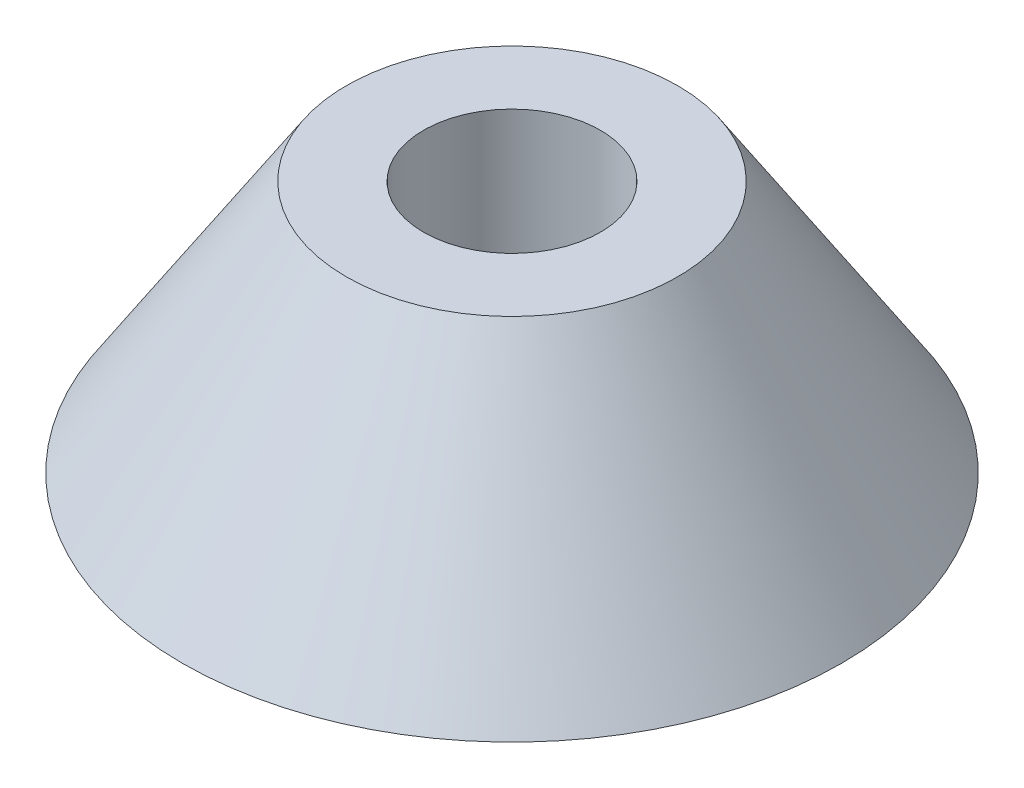
ISO-10303-21;
HEADER;
FILE_DESCRIPTION(('STEP AP214'),'2;1');
FILE_NAME('part.step','',(''),(''),'','','');
FILE_SCHEMA(('AUTOMOTIVE_DESIGN { 1 0 10303 214 1 1 1 1 }'));
ENDSEC;
DATA;
#1=APPLICATION_CONTEXT('core data for automotive mechanical design processes');
#2=APPLICATION_PROTOCOL_DEFINITION('international standard','automotive_design',2000,#1);
#3=PRODUCT_CONTEXT('',#1,'mechanical');
#4=PRODUCT('Part','Part','',(#3));
#5=PRODUCT_RELATED_PRODUCT_CATEGORY('part','',(#4));
#6=PRODUCT_DEFINITION_FORMATION('','',#4);
#7=PRODUCT_DEFINITION_CONTEXT('part definition',#1,'design');
#8=PRODUCT_DEFINITION('design','',#6,#7);
#9=PRODUCT_DEFINITION_SHAPE('','',#8);
#10=(LENGTH_UNIT() NAMED_UNIT(*) SI_UNIT(.MILLI.,.METRE.));
#11=(NAMED_UNIT(*) PLANE_ANGLE_UNIT() SI_UNIT($,.RADIAN.));
#12=(NAMED_UNIT(*) SI_UNIT($,.STERADIAN.) SOLID_ANGLE_UNIT());
#13=UNCERTAINTY_MEASURE_WITH_UNIT(LENGTH_MEASURE(1.E-05),#10,'distance_accuracy_value','');
#14=(GEOMETRIC_REPRESENTATION_CONTEXT(3) GLOBAL_UNCERTAINTY_ASSIGNED_CONTEXT((#13)) GLOBAL_UNIT_ASSIGNED_CONTEXT((#10,
#11,#12)) REPRESENTATION_CONTEXT('',''));
#15=CARTESIAN_POINT('',(0.,0.,0.));
#16=DIRECTION('',(0.,0.,1.));
#17=DIRECTION('',(1.,0.,0.));
#18=AXIS2_PLACEMENT_3D('',#15,#16,#17);
#19=CARTESIAN_POINT('',(0.,5.,0.));
#20=DIRECTION('',(0.,1.,0.));
#21=DIRECTION('',(0.,0.,1.));
#22=AXIS2_PLACEMENT_3D('',#19,#20,#21);
#23=PLANE('',#22);
#24=CARTESIAN_POINT('',(0.,5.,0.));
#25=DIRECTION('',(0.,1.,0.));
#26=DIRECTION('',(0.,0.,1.));
#27=AXIS2_PLACEMENT_3D('',#24,#25,#26);
#28=CIRCLE('',#27,3.2788506442161);
#29=CARTESIAN_POINT('',(0.,5.,3.2788506442161));
#30=VERTEX_POINT('',#29);
#31=EDGE_CURVE('E45',#30,#30,#28,.T.);
#32=ORIENTED_EDGE('',*,*,#31,.T.);
#33=EDGE_LOOP('',(#32));
#34=FACE_BOUND('',#33,.T.);
#35=CARTESIAN_POINT('',(0.,5.,0.));
#36=DIRECTION('',(0.,1.,0.));
#37=DIRECTION('',(0.,0.,1.));
#38=AXIS2_PLACEMENT_3D('',#35,#36,#37);
#39=CIRCLE('',#38,1.75);
#40=CARTESIAN_POINT('',(0.,5.,1.75));
#41=VERTEX_POINT('',#40);
#42=EDGE_CURVE('E50',#41,#41,#39,.T.);
#43=ORIENTED_EDGE('',*,*,#42,.F.);
#44=EDGE_LOOP('',(#43));
#45=FACE_BOUND('',#44,.T.);
#46=ADVANCED_FACE('F37',(#34,#45),#23,.T.);
#47=CARTESIAN_POINT('',(0.,0.,0.));
#48=DIRECTION('',(0.,1.,0.));
#49=DIRECTION('',(0.,0.,1.));
#50=AXIS2_PLACEMENT_3D('',#47,#48,#49);
#51=PLANE('',#50);
#52=CARTESIAN_POINT('',(0.,0.,0.));
#53=DIRECTION('',(0.,1.,0.));
#54=DIRECTION('',(0.,0.,1.));
#55=AXIS2_PLACEMENT_3D('',#52,#53,#54);
#56=CIRCLE('',#55,6.5258886102037);
#57=CARTESIAN_POINT('',(0.,0.,6.5258886102037));
#58=VERTEX_POINT('',#57);
#59=EDGE_CURVE('E10',#58,#58,#56,.F.);
#60=ORIENTED_EDGE('',*,*,#59,.T.);
#61=EDGE_LOOP('',(#60));
#62=FACE_BOUND('',#61,.T.);
#63=CARTESIAN_POINT('',(0.,0.,0.));
#64=DIRECTION('',(0.,1.,0.));
#65=DIRECTION('',(0.,0.,1.));
#66=AXIS2_PLACEMENT_3D('',#63,#64,#65);
#67=CIRCLE('',#66,1.75);
#68=CARTESIAN_POINT('',(0.,0.,1.75));
#69=VERTEX_POINT('',#68);
#70=EDGE_CURVE('E55',#69,#69,#67,.T.);
#71=ORIENTED_EDGE('',*,*,#70,.T.);
#72=EDGE_LOOP('',(#71));
#73=FACE_BOUND('',#72,.T.);
#74=ADVANCED_FACE('F62',(#62,#73),#51,.F.);
#75=CARTESIAN_POINT('',(0.,5.,0.));
#76=DIRECTION('',(0.,-1.,0.));
#77=DIRECTION('',(0.,0.,-1.));
#78=AXIS2_PLACEMENT_3D('',#75,#76,#77);
#79=CYLINDRICAL_SURFACE('',#78,1.75);
#80=ORIENTED_EDGE('',*,*,#42,.T.);
#81=EDGE_LOOP('',(#80));
#82=FACE_BOUND('',#81,.T.);
#83=ORIENTED_EDGE('',*,*,#70,.F.);
#84=EDGE_LOOP('',(#83));
#85=FACE_BOUND('',#84,.T.);
#86=ADVANCED_FACE('F64',(#82,#85),#79,.F.);
#87=CARTESIAN_POINT('',(0.,5.,0.));
#88=DIRECTION('',(0.,-1.,0.));
#89=DIRECTION('',(0.,0.,-1.));
#90=AXIS2_PLACEMENT_3D('',#87,#88,#89);
#91=CONICAL_SURFACE('',#90,3.2788506442161,0.575958653158135);
#92=ORIENTED_EDGE('',*,*,#59,.F.);
#93=EDGE_LOOP('',(#92));
#94=FACE_BOUND('',#93,.T.);
#95=ORIENTED_EDGE('',*,*,#31,.F.);
#96=EDGE_LOOP('',(#95));
#97=FACE_BOUND('',#96,.T.);
#98=ADVANCED_FACE('F39',(#94,#97),#91,.T.);
#99=CLOSED_SHELL('',(#46,#74,#86,#98));
#100=MANIFOLD_SOLID_BREP('B2',#99);
#101=ADVANCED_BREP_SHAPE_REPRESENTATION('',(#18,#100),#14);
#102=SHAPE_DEFINITION_REPRESENTATION(#9,#101);
ENDSEC;
END-ISO-10303-21;
